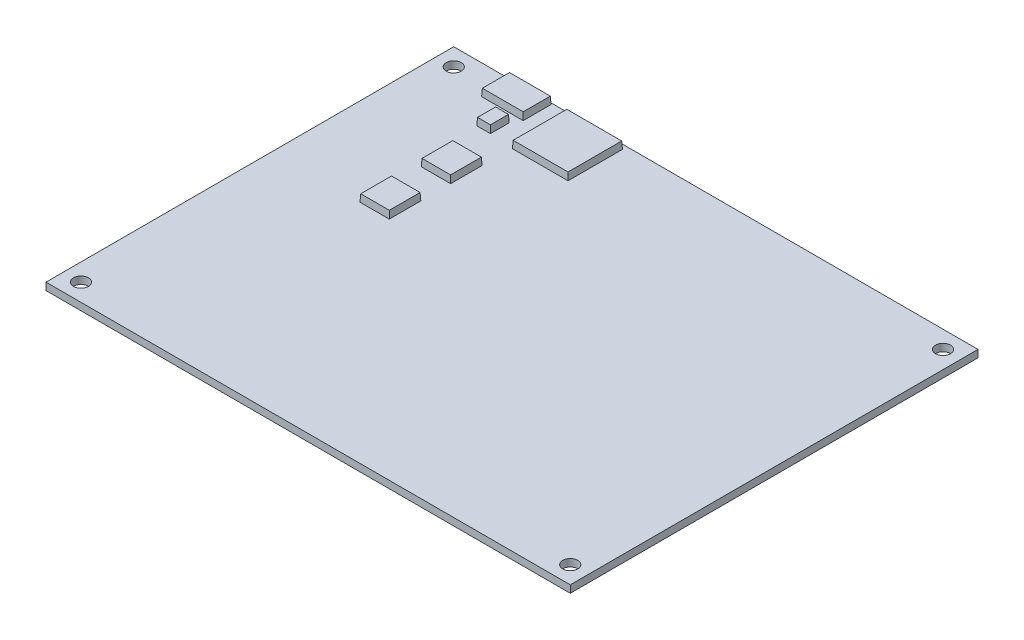
ISO-10303-21;
HEADER;
FILE_DESCRIPTION(('STEP AP214'),'2;1');
FILE_NAME('part.step','',(''),(''),'','','');
FILE_SCHEMA(('AUTOMOTIVE_DESIGN { 1 0 10303 214 1 1 1 1 }'));
ENDSEC;
DATA;
#1=APPLICATION_CONTEXT('core data for automotive mechanical design processes');
#2=APPLICATION_PROTOCOL_DEFINITION('international standard','automotive_design',2000,#1);
#3=PRODUCT_CONTEXT('',#1,'mechanical');
#4=PRODUCT('Part','Part','',(#3));
#5=PRODUCT_RELATED_PRODUCT_CATEGORY('part','',(#4));
#6=PRODUCT_DEFINITION_FORMATION('','',#4);
#7=PRODUCT_DEFINITION_CONTEXT('part definition',#1,'design');
#8=PRODUCT_DEFINITION('design','',#6,#7);
#9=PRODUCT_DEFINITION_SHAPE('','',#8);
#10=(LENGTH_UNIT() NAMED_UNIT(*) SI_UNIT(.MILLI.,.METRE.));
#11=(NAMED_UNIT(*) PLANE_ANGLE_UNIT() SI_UNIT($,.RADIAN.));
#12=(NAMED_UNIT(*) SI_UNIT($,.STERADIAN.) SOLID_ANGLE_UNIT());
#13=UNCERTAINTY_MEASURE_WITH_UNIT(LENGTH_MEASURE(1.E-05),#10,'distance_accuracy_value','');
#14=(GEOMETRIC_REPRESENTATION_CONTEXT(3) GLOBAL_UNCERTAINTY_ASSIGNED_CONTEXT((#13)) GLOBAL_UNIT_ASSIGNED_CONTEXT((#10,
#11,#12)) REPRESENTATION_CONTEXT('',''));
#15=CARTESIAN_POINT('',(0.,0.,0.));
#16=DIRECTION('',(0.,0.,1.));
#17=DIRECTION('',(1.,0.,0.));
#18=AXIS2_PLACEMENT_3D('',#15,#16,#17);
#19=CARTESIAN_POINT('',(57.15,1.6002,-44.45));
#20=DIRECTION('',(0.,-1.,0.));
#21=DIRECTION('',(0.,0.,-1.));
#22=AXIS2_PLACEMENT_3D('',#19,#20,#21);
#23=PLANE('',#22);
#24=DIRECTION('',(0.,0.,1.));
#25=VECTOR('',#24,1.);
#26=CARTESIAN_POINT('',(-31.5034949333632,1.6002,-43.4598801344244));
#27=LINE('',#26,#25);
#28=CARTESIAN_POINT('',(-31.5034949333632,1.6002,-43.4598801344244));
#29=VERTEX_POINT('',#28);
#30=CARTESIAN_POINT('',(-31.5034949333632,1.6002,-31.5915452694734));
#31=VERTEX_POINT('',#30);
#32=EDGE_CURVE('E224',#29,#31,#27,.T.);
#33=ORIENTED_EDGE('',*,*,#32,.F.);
#34=DIRECTION('',(-1.,0.,0.));
#35=VECTOR('',#34,1.);
#36=CARTESIAN_POINT('',(-31.5034949333632,1.6002,-43.4598801344244));
#37=LINE('',#36,#35);
#38=CARTESIAN_POINT('',(-19.3771527887394,1.6002,-43.4598801344244));
#39=VERTEX_POINT('',#38);
#40=EDGE_CURVE('E233',#39,#29,#37,.T.);
#41=ORIENTED_EDGE('',*,*,#40,.F.);
#42=DIRECTION('',(0.,0.,-1.));
#43=VECTOR('',#42,1.);
#44=CARTESIAN_POINT('',(-19.3771527887394,1.6002,-43.4598801344244));
#45=LINE('',#44,#43);
#46=CARTESIAN_POINT('',(-19.3771527887394,1.6002,-31.5915452694734));
#47=VERTEX_POINT('',#46);
#48=EDGE_CURVE('E230',#47,#39,#45,.T.);
#49=ORIENTED_EDGE('',*,*,#48,.F.);
#50=DIRECTION('',(1.,0.,0.));
#51=VECTOR('',#50,1.);
#52=CARTESIAN_POINT('',(-31.5034949333632,1.6002,-31.5915452694734));
#53=LINE('',#52,#51);
#54=EDGE_CURVE('E227',#31,#47,#53,.T.);
#55=ORIENTED_EDGE('',*,*,#54,.F.);
#56=EDGE_LOOP('',(#33,#41,#49,#55));
#57=FACE_BOUND('',#56,.T.);
#58=DIRECTION('',(0.,0.,1.));
#59=VECTOR('',#58,1.);
#60=CARTESIAN_POINT('',(-44.6927167166465,1.6002,-44.1461303469198));
#61=LINE('',#60,#59);
#62=CARTESIAN_POINT('',(-44.6927167166465,1.6002,-44.1461303469198));
#63=VERTEX_POINT('',#62);
#64=CARTESIAN_POINT('',(-44.6927167166465,1.6002,-38.0619014595683));
#65=VERTEX_POINT('',#64);
#66=EDGE_CURVE('E273',#63,#65,#61,.T.);
#67=ORIENTED_EDGE('',*,*,#66,.F.);
#68=DIRECTION('',(-1.,0.,0.));
#69=VECTOR('',#68,1.);
#70=CARTESIAN_POINT('',(-44.6927167166465,1.6002,-44.1461303469198));
#71=LINE('',#70,#69);
#72=CARTESIAN_POINT('',(-35.6248755864591,1.6002,-44.1461303469198));
#73=VERTEX_POINT('',#72);
#74=EDGE_CURVE('E299',#73,#63,#71,.T.);
#75=ORIENTED_EDGE('',*,*,#74,.F.);
#76=DIRECTION('',(0.,0.,-1.));
#77=VECTOR('',#76,1.);
#78=CARTESIAN_POINT('',(-35.6248755864591,1.6002,-44.1461303469198));
#79=LINE('',#78,#77);
#80=CARTESIAN_POINT('',(-35.6248755864591,1.6002,-38.0619014595683));
#81=VERTEX_POINT('',#80);
#82=EDGE_CURVE('E296',#81,#73,#79,.T.);
#83=ORIENTED_EDGE('',*,*,#82,.F.);
#84=DIRECTION('',(1.,0.,0.));
#85=VECTOR('',#84,1.);
#86=CARTESIAN_POINT('',(-44.6927167166465,1.6002,-38.0619014595683));
#87=LINE('',#86,#85);
#88=EDGE_CURVE('E293',#65,#81,#87,.T.);
#89=ORIENTED_EDGE('',*,*,#88,.F.);
#90=EDGE_LOOP('',(#67,#75,#83,#89));
#91=FACE_BOUND('',#90,.T.);
#92=DIRECTION('',(0.,0.,-1.));
#93=VECTOR('',#92,1.);
#94=CARTESIAN_POINT('',(57.15,1.6002,6.35000000000002));
#95=LINE('',#94,#93);
#96=CARTESIAN_POINT('',(57.15,1.6002,44.45));
#97=VERTEX_POINT('',#96);
#98=CARTESIAN_POINT('',(57.15,1.6002,-44.45));
#99=VERTEX_POINT('',#98);
#100=EDGE_CURVE('E381',#97,#99,#95,.T.);
#101=ORIENTED_EDGE('',*,*,#100,.T.);
#102=DIRECTION('',(-1.,0.,0.));
#103=VECTOR('',#102,1.);
#104=CARTESIAN_POINT('',(-57.15,1.6002,-44.45));
#105=LINE('',#104,#103);
#106=CARTESIAN_POINT('',(-57.15,1.6002,-44.45));
#107=VERTEX_POINT('',#106);
#108=EDGE_CURVE('E384',#99,#107,#105,.T.);
#109=ORIENTED_EDGE('',*,*,#108,.T.);
#110=DIRECTION('',(0.,0.,1.));
#111=VECTOR('',#110,1.);
#112=CARTESIAN_POINT('',(-57.15,1.6002,6.35000000000002));
#113=LINE('',#112,#111);
#114=CARTESIAN_POINT('',(-57.15,1.6002,44.45));
#115=VERTEX_POINT('',#114);
#116=EDGE_CURVE('E387',#107,#115,#113,.T.);
#117=ORIENTED_EDGE('',*,*,#116,.T.);
#118=DIRECTION('',(1.,0.,0.));
#119=VECTOR('',#118,1.);
#120=CARTESIAN_POINT('',(-57.15,1.6002,44.45));
#121=LINE('',#120,#119);
#122=EDGE_CURVE('E389',#115,#97,#121,.T.);
#123=ORIENTED_EDGE('',*,*,#122,.T.);
#124=EDGE_LOOP('',(#101,#109,#117,#123));
#125=FACE_BOUND('',#124,.T.);
#126=CARTESIAN_POINT('',(-53.34,1.6002,40.64));
#127=DIRECTION('',(0.,1.,0.));
#128=DIRECTION('',(0.,0.,1.));
#129=AXIS2_PLACEMENT_3D('',#126,#127,#128);
#130=CIRCLE('',#129,1.63194999999999);
#131=CARTESIAN_POINT('',(-53.34,1.6002,42.27195));
#132=VERTEX_POINT('',#131);
#133=EDGE_CURVE('E374',#132,#132,#130,.T.);
#134=ORIENTED_EDGE('',*,*,#133,.F.);
#135=EDGE_LOOP('',(#134));
#136=FACE_BOUND('',#135,.T.);
#137=CARTESIAN_POINT('',(53.34,1.6002,40.64));
#138=DIRECTION('',(0.,1.,0.));
#139=DIRECTION('',(0.,0.,1.));
#140=AXIS2_PLACEMENT_3D('',#137,#138,#139);
#141=CIRCLE('',#140,1.63194999999999);
#142=CARTESIAN_POINT('',(53.34,1.6002,42.27195));
#143=VERTEX_POINT('',#142);
#144=EDGE_CURVE('E368',#143,#143,#141,.T.);
#145=ORIENTED_EDGE('',*,*,#144,.F.);
#146=EDGE_LOOP('',(#145));
#147=FACE_BOUND('',#146,.T.);
#148=CARTESIAN_POINT('',(53.34,1.6002,-40.64));
#149=DIRECTION('',(0.,1.,0.));
#150=DIRECTION('',(0.,0.,1.));
#151=AXIS2_PLACEMENT_3D('',#148,#149,#150);
#152=CIRCLE('',#151,1.63194999999999);
#153=CARTESIAN_POINT('',(53.34,1.6002,-39.00805));
#154=VERTEX_POINT('',#153);
#155=EDGE_CURVE('E362',#154,#154,#152,.T.);
#156=ORIENTED_EDGE('',*,*,#155,.F.);
#157=EDGE_LOOP('',(#156));
#158=FACE_BOUND('',#157,.T.);
#159=CARTESIAN_POINT('',(-53.34,1.6002,-40.64));
#160=DIRECTION('',(0.,1.,0.));
#161=DIRECTION('',(0.,0.,1.));
#162=AXIS2_PLACEMENT_3D('',#159,#160,#161);
#163=CIRCLE('',#162,1.63194999999999);
#164=CARTESIAN_POINT('',(-53.34,1.6002,-39.00805));
#165=VERTEX_POINT('',#164);
#166=EDGE_CURVE('E339',#165,#165,#163,.T.);
#167=ORIENTED_EDGE('',*,*,#166,.F.);
#168=EDGE_LOOP('',(#167));
#169=FACE_BOUND('',#168,.T.);
#170=DIRECTION('',(0.,0.,1.));
#171=VECTOR('',#170,1.);
#172=CARTESIAN_POINT('',(-38.0206695409304,1.6002,-25.1215308192296));
#173=LINE('',#172,#171);
#174=CARTESIAN_POINT('',(-38.0206695409304,1.6002,-25.1215308192296));
#175=VERTEX_POINT('',#174);
#176=CARTESIAN_POINT('',(-38.0206695409304,1.6002,-18.2413366946203));
#177=VERTEX_POINT('',#176);
#178=EDGE_CURVE('E306',#175,#177,#173,.T.);
#179=ORIENTED_EDGE('',*,*,#178,.F.);
#180=DIRECTION('',(-1.,0.,0.));
#181=VECTOR('',#180,1.);
#182=CARTESIAN_POINT('',(-38.0206695409304,1.6002,-25.1215308192296));
#183=LINE('',#182,#181);
#184=CARTESIAN_POINT('',(-31.6279105092975,1.6002,-25.1215308192296));
#185=VERTEX_POINT('',#184);
#186=EDGE_CURVE('E332',#185,#175,#183,.T.);
#187=ORIENTED_EDGE('',*,*,#186,.F.);
#188=DIRECTION('',(0.,0.,-1.));
#189=VECTOR('',#188,1.);
#190=CARTESIAN_POINT('',(-31.6279105092975,1.6002,-25.1215308192296));
#191=LINE('',#190,#189);
#192=CARTESIAN_POINT('',(-31.6279105092975,1.6002,-18.2413366946203));
#193=VERTEX_POINT('',#192);
#194=EDGE_CURVE('E329',#193,#185,#191,.T.);
#195=ORIENTED_EDGE('',*,*,#194,.F.);
#196=DIRECTION('',(1.,0.,0.));
#197=VECTOR('',#196,1.);
#198=CARTESIAN_POINT('',(-38.0206695409304,1.6002,-18.2413366946203));
#199=LINE('',#198,#197);
#200=EDGE_CURVE('E326',#177,#193,#199,.T.);
#201=ORIENTED_EDGE('',*,*,#200,.F.);
#202=EDGE_LOOP('',(#179,#187,#195,#201));
#203=FACE_BOUND('',#202,.T.);
#204=DIRECTION('',(0.,0.,1.));
#205=VECTOR('',#204,1.);
#206=CARTESIAN_POINT('',(-38.0206695409304,1.6002,-11.7502275240392));
#207=LINE('',#206,#205);
#208=CARTESIAN_POINT('',(-38.0206695409304,1.6002,-11.7502275240392));
#209=VERTEX_POINT('',#208);
#210=CARTESIAN_POINT('',(-38.0206695409304,1.6002,-4.87003339942996));
#211=VERTEX_POINT('',#210);
#212=EDGE_CURVE('E240',#209,#211,#207,.T.);
#213=ORIENTED_EDGE('',*,*,#212,.F.);
#214=DIRECTION('',(-1.,0.,0.));
#215=VECTOR('',#214,1.);
#216=CARTESIAN_POINT('',(-38.0206695409304,1.6002,-11.7502275240392));
#217=LINE('',#216,#215);
#218=CARTESIAN_POINT('',(-31.6279105092975,1.6002,-11.7502275240392));
#219=VERTEX_POINT('',#218);
#220=EDGE_CURVE('E266',#219,#209,#217,.T.);
#221=ORIENTED_EDGE('',*,*,#220,.F.);
#222=DIRECTION('',(0.,0.,-1.));
#223=VECTOR('',#222,1.);
#224=CARTESIAN_POINT('',(-31.6279105092975,1.6002,-11.7502275240392));
#225=LINE('',#224,#223);
#226=CARTESIAN_POINT('',(-31.6279105092975,1.6002,-4.87003339942996));
#227=VERTEX_POINT('',#226);
#228=EDGE_CURVE('E263',#227,#219,#225,.T.);
#229=ORIENTED_EDGE('',*,*,#228,.F.);
#230=DIRECTION('',(1.,0.,0.));
#231=VECTOR('',#230,1.);
#232=CARTESIAN_POINT('',(-38.0206695409304,1.6002,-4.87003339942996));
#233=LINE('',#232,#231);
#234=EDGE_CURVE('E260',#211,#227,#233,.T.);
#235=ORIENTED_EDGE('',*,*,#234,.F.);
#236=EDGE_LOOP('',(#213,#221,#229,#235));
#237=FACE_BOUND('',#236,.T.);
#238=DIRECTION('',(0.,0.,1.));
#239=VECTOR('',#238,1.);
#240=CARTESIAN_POINT('',(-39.7200296452534,1.6002,-36.131328831851));
#241=LINE('',#240,#239);
#242=CARTESIAN_POINT('',(-39.7200296452534,1.6002,-36.131328831851));
#243=VERTEX_POINT('',#242);
#244=CARTESIAN_POINT('',(-39.7200296452534,1.6002,-32.0361747730567));
#245=VERTEX_POINT('',#244);
#246=EDGE_CURVE('E189',#243,#245,#241,.T.);
#247=ORIENTED_EDGE('',*,*,#246,.F.);
#248=DIRECTION('',(-1.,0.,0.));
#249=VECTOR('',#248,1.);
#250=CARTESIAN_POINT('',(-39.7200296452534,1.6002,-36.131328831851));
#251=LINE('',#250,#249);
#252=CARTESIAN_POINT('',(-36.7364174024176,1.6002,-36.131328831851));
#253=VERTEX_POINT('',#252);
#254=EDGE_CURVE('E191',#253,#243,#251,.T.);
#255=ORIENTED_EDGE('',*,*,#254,.F.);
#256=DIRECTION('',(0.,0.,-1.));
#257=VECTOR('',#256,1.);
#258=CARTESIAN_POINT('',(-36.7364174024176,1.6002,-36.131328831851));
#259=LINE('',#258,#257);
#260=CARTESIAN_POINT('',(-36.7364174024176,1.6002,-32.0361747730567));
#261=VERTEX_POINT('',#260);
#262=EDGE_CURVE('E52',#261,#253,#259,.T.);
#263=ORIENTED_EDGE('',*,*,#262,.F.);
#264=DIRECTION('',(1.,0.,0.));
#265=VECTOR('',#264,1.);
#266=CARTESIAN_POINT('',(-39.7200296452534,1.6002,-32.0361747730567));
#267=LINE('',#266,#265);
#268=EDGE_CURVE('E47',#245,#261,#267,.T.);
#269=ORIENTED_EDGE('',*,*,#268,.F.);
#270=EDGE_LOOP('',(#247,#255,#263,#269));
#271=FACE_BOUND('',#270,.T.);
#272=ADVANCED_FACE('F32',(#57,#91,#125,#136,#147,#158,#169,#203,#237,#271),#23,.F.);
#273=CARTESIAN_POINT('',(-57.15,1.6002,-44.45));
#274=DIRECTION('',(0.,0.,1.));
#275=DIRECTION('',(1.,0.,0.));
#276=AXIS2_PLACEMENT_3D('',#273,#274,#275);
#277=PLANE('',#276);
#278=DIRECTION('',(-1.,0.,0.));
#279=VECTOR('',#278,1.);
#280=CARTESIAN_POINT('',(-57.15,0.,-44.45));
#281=LINE('',#280,#279);
#282=CARTESIAN_POINT('',(57.15,0.,-44.45));
#283=VERTEX_POINT('',#282);
#284=CARTESIAN_POINT('',(-57.15,0.,-44.45));
#285=VERTEX_POINT('',#284);
#286=EDGE_CURVE('E380',#283,#285,#281,.T.);
#287=ORIENTED_EDGE('',*,*,#286,.T.);
#288=DIRECTION('',(0.,-1.,0.));
#289=VECTOR('',#288,1.);
#290=CARTESIAN_POINT('',(-57.15,1.6002,-44.45));
#291=LINE('',#290,#289);
#292=EDGE_CURVE('E40',#107,#285,#291,.T.);
#293=ORIENTED_EDGE('',*,*,#292,.F.);
#294=ORIENTED_EDGE('',*,*,#108,.F.);
#295=DIRECTION('',(0.,-1.,0.));
#296=VECTOR('',#295,1.);
#297=CARTESIAN_POINT('',(57.15,1.6002,-44.45));
#298=LINE('',#297,#296);
#299=EDGE_CURVE('E11',#99,#283,#298,.T.);
#300=ORIENTED_EDGE('',*,*,#299,.T.);
#301=EDGE_LOOP('',(#287,#293,#294,#300));
#302=FACE_BOUND('',#301,.T.);
#303=ADVANCED_FACE('F34',(#302),#277,.F.);
#304=CARTESIAN_POINT('',(-57.15,1.6002,44.45));
#305=DIRECTION('',(1.,0.,0.));
#306=DIRECTION('',(0.,0.,-1.));
#307=AXIS2_PLACEMENT_3D('',#304,#305,#306);
#308=PLANE('',#307);
#309=DIRECTION('',(0.,0.,1.));
#310=VECTOR('',#309,1.);
#311=CARTESIAN_POINT('',(-57.15,0.,44.45));
#312=LINE('',#311,#310);
#313=CARTESIAN_POINT('',(-57.15,0.,44.45));
#314=VERTEX_POINT('',#313);
#315=EDGE_CURVE('E394',#285,#314,#312,.T.);
#316=ORIENTED_EDGE('',*,*,#315,.T.);
#317=DIRECTION('',(0.,-1.,0.));
#318=VECTOR('',#317,1.);
#319=CARTESIAN_POINT('',(-57.15,1.6002,44.45));
#320=LINE('',#319,#318);
#321=EDGE_CURVE('E402',#115,#314,#320,.T.);
#322=ORIENTED_EDGE('',*,*,#321,.F.);
#323=ORIENTED_EDGE('',*,*,#116,.F.);
#324=ORIENTED_EDGE('',*,*,#292,.T.);
#325=EDGE_LOOP('',(#316,#322,#323,#324));
#326=FACE_BOUND('',#325,.T.);
#327=ADVANCED_FACE('F408',(#326),#308,.F.);
#328=CARTESIAN_POINT('',(57.15,1.6002,44.45));
#329=DIRECTION('',(0.,0.,-1.));
#330=DIRECTION('',(-1.,0.,0.));
#331=AXIS2_PLACEMENT_3D('',#328,#329,#330);
#332=PLANE('',#331);
#333=DIRECTION('',(1.,0.,0.));
#334=VECTOR('',#333,1.);
#335=CARTESIAN_POINT('',(57.15,0.,44.45));
#336=LINE('',#335,#334);
#337=CARTESIAN_POINT('',(57.15,0.,44.45));
#338=VERTEX_POINT('',#337);
#339=EDGE_CURVE('E397',#314,#338,#336,.T.);
#340=ORIENTED_EDGE('',*,*,#339,.T.);
#341=DIRECTION('',(0.,-1.,0.));
#342=VECTOR('',#341,1.);
#343=CARTESIAN_POINT('',(57.15,1.6002,44.45));
#344=LINE('',#343,#342);
#345=EDGE_CURVE('E391',#97,#338,#344,.T.);
#346=ORIENTED_EDGE('',*,*,#345,.F.);
#347=ORIENTED_EDGE('',*,*,#122,.F.);
#348=ORIENTED_EDGE('',*,*,#321,.T.);
#349=EDGE_LOOP('',(#340,#346,#347,#348));
#350=FACE_BOUND('',#349,.T.);
#351=ADVANCED_FACE('F418',(#350),#332,.F.);
#352=CARTESIAN_POINT('',(57.15,1.6002,44.45));
#353=DIRECTION('',(-1.,0.,0.));
#354=DIRECTION('',(0.,0.,1.));
#355=AXIS2_PLACEMENT_3D('',#352,#353,#354);
#356=PLANE('',#355);
#357=DIRECTION('',(0.,0.,-1.));
#358=VECTOR('',#357,1.);
#359=CARTESIAN_POINT('',(57.15,0.,44.45));
#360=LINE('',#359,#358);
#361=EDGE_CURVE('E385',#338,#283,#360,.T.);
#362=ORIENTED_EDGE('',*,*,#361,.T.);
#363=ORIENTED_EDGE('',*,*,#299,.F.);
#364=ORIENTED_EDGE('',*,*,#100,.F.);
#365=ORIENTED_EDGE('',*,*,#345,.T.);
#366=EDGE_LOOP('',(#362,#363,#364,#365));
#367=FACE_BOUND('',#366,.T.);
#368=ADVANCED_FACE('F422',(#367),#356,.F.);
#369=CARTESIAN_POINT('',(57.15,0.,-44.45));
#370=DIRECTION('',(0.,-1.,0.));
#371=DIRECTION('',(0.,0.,-1.));
#372=AXIS2_PLACEMENT_3D('',#369,#370,#371);
#373=PLANE('',#372);
#374=CARTESIAN_POINT('',(-53.34,0.,-40.64));
#375=DIRECTION('',(0.,1.,0.));
#376=DIRECTION('',(0.,0.,1.));
#377=AXIS2_PLACEMENT_3D('',#374,#375,#376);
#378=CIRCLE('',#377,1.63195);
#379=CARTESIAN_POINT('',(-53.34,0.,-39.00805));
#380=VERTEX_POINT('',#379);
#381=EDGE_CURVE('E359',#380,#380,#378,.T.);
#382=ORIENTED_EDGE('',*,*,#381,.T.);
#383=EDGE_LOOP('',(#382));
#384=FACE_BOUND('',#383,.T.);
#385=CARTESIAN_POINT('',(53.34,0.,-40.64));
#386=DIRECTION('',(0.,1.,0.));
#387=DIRECTION('',(0.,0.,1.));
#388=AXIS2_PLACEMENT_3D('',#385,#386,#387);
#389=CIRCLE('',#388,1.63195);
#390=CARTESIAN_POINT('',(53.34,0.,-39.00805));
#391=VERTEX_POINT('',#390);
#392=EDGE_CURVE('E365',#391,#391,#389,.T.);
#393=ORIENTED_EDGE('',*,*,#392,.T.);
#394=EDGE_LOOP('',(#393));
#395=FACE_BOUND('',#394,.T.);
#396=CARTESIAN_POINT('',(53.34,0.,40.64));
#397=DIRECTION('',(0.,1.,0.));
#398=DIRECTION('',(0.,0.,1.));
#399=AXIS2_PLACEMENT_3D('',#396,#397,#398);
#400=CIRCLE('',#399,1.63195);
#401=CARTESIAN_POINT('',(53.34,0.,42.27195));
#402=VERTEX_POINT('',#401);
#403=EDGE_CURVE('E371',#402,#402,#400,.T.);
#404=ORIENTED_EDGE('',*,*,#403,.T.);
#405=EDGE_LOOP('',(#404));
#406=FACE_BOUND('',#405,.T.);
#407=CARTESIAN_POINT('',(-53.34,0.,40.64));
#408=DIRECTION('',(0.,1.,0.));
#409=DIRECTION('',(0.,0.,1.));
#410=AXIS2_PLACEMENT_3D('',#407,#408,#409);
#411=CIRCLE('',#410,1.63195);
#412=CARTESIAN_POINT('',(-53.34,0.,42.27195));
#413=VERTEX_POINT('',#412);
#414=EDGE_CURVE('E377',#413,#413,#411,.T.);
#415=ORIENTED_EDGE('',*,*,#414,.T.);
#416=EDGE_LOOP('',(#415));
#417=FACE_BOUND('',#416,.T.);
#418=ORIENTED_EDGE('',*,*,#286,.F.);
#419=ORIENTED_EDGE('',*,*,#361,.F.);
#420=ORIENTED_EDGE('',*,*,#339,.F.);
#421=ORIENTED_EDGE('',*,*,#315,.F.);
#422=EDGE_LOOP('',(#418,#419,#420,#421));
#423=FACE_BOUND('',#422,.T.);
#424=ADVANCED_FACE('F415',(#384,#395,#406,#417,#423),#373,.T.);
#425=CARTESIAN_POINT('',(-53.34,1.6002,40.64));
#426=DIRECTION('',(0.,1.,0.));
#427=DIRECTION('',(0.,0.,1.));
#428=AXIS2_PLACEMENT_3D('',#425,#426,#427);
#429=CYLINDRICAL_SURFACE('',#428,1.63194999999999);
#430=ORIENTED_EDGE('',*,*,#414,.F.);
#431=EDGE_LOOP('',(#430));
#432=FACE_BOUND('',#431,.T.);
#433=ORIENTED_EDGE('',*,*,#133,.T.);
#434=EDGE_LOOP('',(#433));
#435=FACE_BOUND('',#434,.T.);
#436=ADVANCED_FACE('F515',(#432,#435),#429,.F.);
#437=CARTESIAN_POINT('',(53.34,1.6002,40.64));
#438=DIRECTION('',(0.,1.,0.));
#439=DIRECTION('',(0.,0.,1.));
#440=AXIS2_PLACEMENT_3D('',#437,#438,#439);
#441=CYLINDRICAL_SURFACE('',#440,1.63194999999999);
#442=ORIENTED_EDGE('',*,*,#403,.F.);
#443=EDGE_LOOP('',(#442));
#444=FACE_BOUND('',#443,.T.);
#445=ORIENTED_EDGE('',*,*,#144,.T.);
#446=EDGE_LOOP('',(#445));
#447=FACE_BOUND('',#446,.T.);
#448=ADVANCED_FACE('F511',(#444,#447),#441,.F.);
#449=CARTESIAN_POINT('',(53.34,1.6002,-40.64));
#450=DIRECTION('',(0.,1.,0.));
#451=DIRECTION('',(0.,0.,1.));
#452=AXIS2_PLACEMENT_3D('',#449,#450,#451);
#453=CYLINDRICAL_SURFACE('',#452,1.63194999999999);
#454=ORIENTED_EDGE('',*,*,#392,.F.);
#455=EDGE_LOOP('',(#454));
#456=FACE_BOUND('',#455,.T.);
#457=ORIENTED_EDGE('',*,*,#155,.T.);
#458=EDGE_LOOP('',(#457));
#459=FACE_BOUND('',#458,.T.);
#460=ADVANCED_FACE('F507',(#456,#459),#453,.F.);
#461=CARTESIAN_POINT('',(-53.34,1.6002,-40.64));
#462=DIRECTION('',(0.,1.,0.));
#463=DIRECTION('',(0.,0.,1.));
#464=AXIS2_PLACEMENT_3D('',#461,#462,#463);
#465=CYLINDRICAL_SURFACE('',#464,1.63194999999999);
#466=ORIENTED_EDGE('',*,*,#381,.F.);
#467=EDGE_LOOP('',(#466));
#468=FACE_BOUND('',#467,.T.);
#469=ORIENTED_EDGE('',*,*,#166,.T.);
#470=EDGE_LOOP('',(#469));
#471=FACE_BOUND('',#470,.T.);
#472=ADVANCED_FACE('F493',(#468,#471),#465,.F.);
#473=CARTESIAN_POINT('',(-38.0206695409304,1.6002,-25.1215308192296));
#474=DIRECTION('',(-0.998629534754574,0.0523359562429439,0.));
#475=DIRECTION('',(-0.052335956242944,-0.998629534754574,0.));
#476=AXIS2_PLACEMENT_3D('',#473,#474,#475);
#477=PLANE('',#476);
#478=ORIENTED_EDGE('',*,*,#178,.T.);
#479=DIRECTION('',(-0.052264427688714,-0.997264688634237,0.052264427688714));
#480=VECTOR('',#479,1.);
#481=CARTESIAN_POINT('',(-38.0206695409304,1.6002,-18.2413366946203));
#482=LINE('',#481,#480);
#483=CARTESIAN_POINT('',(-37.9374721913186,3.1877,-18.3245340442322));
#484=VERTEX_POINT('',#483);
#485=EDGE_CURVE('E336',#484,#177,#482,.T.);
#486=ORIENTED_EDGE('',*,*,#485,.F.);
#487=DIRECTION('',(0.,0.,-1.));
#488=VECTOR('',#487,1.);
#489=CARTESIAN_POINT('',(-37.9374721913186,3.1877,-25.1215308192296));
#490=LINE('',#489,#488);
#491=CARTESIAN_POINT('',(-37.9374721913186,3.1877,-25.0383334696178));
#492=VERTEX_POINT('',#491);
#493=EDGE_CURVE('E335',#492,#484,#490,.F.);
#494=ORIENTED_EDGE('',*,*,#493,.F.);
#495=DIRECTION('',(-0.052264427688714,-0.997264688634237,-0.052264427688714));
#496=VECTOR('',#495,1.);
#497=CARTESIAN_POINT('',(-38.0206695409304,1.6002,-25.1215308192296));
#498=LINE('',#497,#496);
#499=EDGE_CURVE('E341',#492,#175,#498,.T.);
#500=ORIENTED_EDGE('',*,*,#499,.T.);
#501=EDGE_LOOP('',(#478,#486,#494,#500));
#502=FACE_BOUND('',#501,.T.);
#503=ADVANCED_FACE('F489',(#502),#477,.T.);
#504=CARTESIAN_POINT('',(-38.0206695409304,1.6002,-18.2413366946203));
#505=DIRECTION('',(0.,0.0523359562429439,0.998629534754574));
#506=DIRECTION('',(0.,-0.998629534754574,0.052335956242944));
#507=AXIS2_PLACEMENT_3D('',#504,#505,#506);
#508=PLANE('',#507);
#509=ORIENTED_EDGE('',*,*,#200,.T.);
#510=DIRECTION('',(0.052264427688714,-0.997264688634237,0.052264427688714));
#511=VECTOR('',#510,1.);
#512=CARTESIAN_POINT('',(-31.6467042439257,1.9588058193144,-18.2601304292486));
#513=LINE('',#512,#511);
#514=CARTESIAN_POINT('',(-31.7111078589093,3.1877,-18.3245340442322));
#515=VERTEX_POINT('',#514);
#516=EDGE_CURVE('E340',#515,#193,#513,.T.);
#517=ORIENTED_EDGE('',*,*,#516,.F.);
#518=DIRECTION('',(-1.,0.,0.));
#519=VECTOR('',#518,1.);
#520=CARTESIAN_POINT('',(-38.0206695409304,3.1877,-18.3245340442322));
#521=LINE('',#520,#519);
#522=EDGE_CURVE('E352',#484,#515,#521,.F.);
#523=ORIENTED_EDGE('',*,*,#522,.F.);
#524=ORIENTED_EDGE('',*,*,#485,.T.);
#525=EDGE_LOOP('',(#509,#517,#523,#524));
#526=FACE_BOUND('',#525,.T.);
#527=ADVANCED_FACE('F492',(#526),#508,.T.);
#528=CARTESIAN_POINT('',(-31.6279105092975,1.6002,-25.1215308192296));
#529=DIRECTION('',(0.998629534754574,0.0523359562429439,0.));
#530=DIRECTION('',(-0.052335956242944,0.998629534754574,0.));
#531=AXIS2_PLACEMENT_3D('',#528,#529,#530);
#532=PLANE('',#531);
#533=ORIENTED_EDGE('',*,*,#194,.T.);
#534=DIRECTION('',(0.052264427688714,-0.997264688634237,-0.052264427688714));
#535=VECTOR('',#534,1.);
#536=CARTESIAN_POINT('',(-31.6453727806531,1.93339998661352,-25.104068547874));
#537=LINE('',#536,#535);
#538=CARTESIAN_POINT('',(-31.7111078589093,3.1877,-25.0383334696178));
#539=VERTEX_POINT('',#538);
#540=EDGE_CURVE('E344',#539,#185,#537,.T.);
#541=ORIENTED_EDGE('',*,*,#540,.F.);
#542=DIRECTION('',(0.,0.,1.));
#543=VECTOR('',#542,1.);
#544=CARTESIAN_POINT('',(-31.7111078589093,3.1877,-25.1215308192296));
#545=LINE('',#544,#543);
#546=EDGE_CURVE('E354',#515,#539,#545,.F.);
#547=ORIENTED_EDGE('',*,*,#546,.F.);
#548=ORIENTED_EDGE('',*,*,#516,.T.);
#549=EDGE_LOOP('',(#533,#541,#547,#548));
#550=FACE_BOUND('',#549,.T.);
#551=ADVANCED_FACE('F497',(#550),#532,.T.);
#552=CARTESIAN_POINT('',(-38.0206695409304,1.6002,-25.1215308192296));
#553=DIRECTION('',(0.,0.0523359562429439,-0.998629534754574));
#554=DIRECTION('',(0.,0.998629534754574,0.052335956242944));
#555=AXIS2_PLACEMENT_3D('',#552,#553,#554);
#556=PLANE('',#555);
#557=ORIENTED_EDGE('',*,*,#186,.T.);
#558=ORIENTED_EDGE('',*,*,#499,.F.);
#559=DIRECTION('',(1.,0.,0.));
#560=VECTOR('',#559,1.);
#561=CARTESIAN_POINT('',(-38.0206695409304,3.1877,-25.0383334696178));
#562=LINE('',#561,#560);
#563=EDGE_CURVE('E345',#539,#492,#562,.F.);
#564=ORIENTED_EDGE('',*,*,#563,.F.);
#565=ORIENTED_EDGE('',*,*,#540,.T.);
#566=EDGE_LOOP('',(#557,#558,#564,#565));
#567=FACE_BOUND('',#566,.T.);
#568=ADVANCED_FACE('F487',(#567),#556,.T.);
#569=CARTESIAN_POINT('',(-38.0206695409304,3.1877,-18.2413366946203));
#570=DIRECTION('',(0.,1.,0.));
#571=DIRECTION('',(0.,0.,1.));
#572=AXIS2_PLACEMENT_3D('',#569,#570,#571);
#573=PLANE('',#572);
#574=ORIENTED_EDGE('',*,*,#493,.T.);
#575=ORIENTED_EDGE('',*,*,#522,.T.);
#576=ORIENTED_EDGE('',*,*,#546,.T.);
#577=ORIENTED_EDGE('',*,*,#563,.T.);
#578=EDGE_LOOP('',(#574,#575,#576,#577));
#579=FACE_BOUND('',#578,.T.);
#580=ADVANCED_FACE('F473',(#579),#573,.T.);
#581=CARTESIAN_POINT('',(-44.6927167166465,1.6002,-44.1461303469198));
#582=DIRECTION('',(-0.998629534754574,0.0523359562429439,0.));
#583=DIRECTION('',(-0.052335956242944,-0.998629534754574,0.));
#584=AXIS2_PLACEMENT_3D('',#581,#582,#583);
#585=PLANE('',#584);
#586=ORIENTED_EDGE('',*,*,#66,.T.);
#587=DIRECTION('',(-0.052264427688714,-0.997264688634237,0.052264427688714));
#588=VECTOR('',#587,1.);
#589=CARTESIAN_POINT('',(-44.6927167166465,1.6002,-38.0619014595683));
#590=LINE('',#589,#588);
#591=CARTESIAN_POINT('',(-44.6095193670347,3.1877,-38.1450988091801));
#592=VERTEX_POINT('',#591);
#593=EDGE_CURVE('E303',#592,#65,#590,.T.);
#594=ORIENTED_EDGE('',*,*,#593,.F.);
#595=DIRECTION('',(0.,0.,-1.));
#596=VECTOR('',#595,1.);
#597=CARTESIAN_POINT('',(-44.6095193670347,3.1877,-44.1461303469198));
#598=LINE('',#597,#596);
#599=CARTESIAN_POINT('',(-44.6095193670347,3.1877,-44.062932997308));
#600=VERTEX_POINT('',#599);
#601=EDGE_CURVE('E302',#600,#592,#598,.F.);
#602=ORIENTED_EDGE('',*,*,#601,.F.);
#603=DIRECTION('',(-0.052264427688714,-0.997264688634237,-0.052264427688714));
#604=VECTOR('',#603,1.);
#605=CARTESIAN_POINT('',(-44.6927167166465,1.6002,-44.1461303469198));
#606=LINE('',#605,#604);
#607=EDGE_CURVE('E308',#600,#63,#606,.T.);
#608=ORIENTED_EDGE('',*,*,#607,.T.);
#609=EDGE_LOOP('',(#586,#594,#602,#608));
#610=FACE_BOUND('',#609,.T.);
#611=ADVANCED_FACE('F469',(#610),#585,.T.);
#612=CARTESIAN_POINT('',(-44.6927167166465,1.6002,-38.0619014595683));
#613=DIRECTION('',(0.,0.0523359562429439,0.998629534754574));
#614=DIRECTION('',(0.,-0.998629534754574,0.052335956242944));
#615=AXIS2_PLACEMENT_3D('',#612,#613,#614);
#616=PLANE('',#615);
#617=ORIENTED_EDGE('',*,*,#88,.T.);
#618=DIRECTION('',(0.052264427688714,-0.997264688634237,0.052264427688714));
#619=VECTOR('',#618,1.);
#620=CARTESIAN_POINT('',(-35.6414950860045,1.91731894250788,-38.0785209591137));
#621=LINE('',#620,#619);
#622=CARTESIAN_POINT('',(-35.7080729360709,3.1877,-38.1450988091801));
#623=VERTEX_POINT('',#622);
#624=EDGE_CURVE('E307',#623,#81,#621,.T.);
#625=ORIENTED_EDGE('',*,*,#624,.F.);
#626=DIRECTION('',(-1.,0.,0.));
#627=VECTOR('',#626,1.);
#628=CARTESIAN_POINT('',(-44.6927167166465,3.1877,-38.1450988091801));
#629=LINE('',#628,#627);
#630=EDGE_CURVE('E319',#592,#623,#629,.F.);
#631=ORIENTED_EDGE('',*,*,#630,.F.);
#632=ORIENTED_EDGE('',*,*,#593,.T.);
#633=EDGE_LOOP('',(#617,#625,#631,#632));
#634=FACE_BOUND('',#633,.T.);
#635=ADVANCED_FACE('F472',(#634),#616,.T.);
#636=CARTESIAN_POINT('',(-35.6248755864591,1.6002,-44.1461303469198));
#637=DIRECTION('',(0.998629534754574,0.0523359562429439,0.));
#638=DIRECTION('',(-0.052335956242944,0.998629534754574,0.));
#639=AXIS2_PLACEMENT_3D('',#636,#637,#638);
#640=PLANE('',#639);
#641=ORIENTED_EDGE('',*,*,#82,.T.);
#642=DIRECTION('',(0.052264427688714,-0.997264688634237,-0.052264427688714));
#643=VECTOR('',#642,1.);
#644=CARTESIAN_POINT('',(-35.649645032897,2.07282919316078,-44.1213609004819));
#645=LINE('',#644,#643);
#646=CARTESIAN_POINT('',(-35.7080729360709,3.1877,-44.062932997308));
#647=VERTEX_POINT('',#646);
#648=EDGE_CURVE('E311',#647,#73,#645,.T.);
#649=ORIENTED_EDGE('',*,*,#648,.F.);
#650=DIRECTION('',(0.,0.,1.));
#651=VECTOR('',#650,1.);
#652=CARTESIAN_POINT('',(-35.7080729360709,3.1877,-44.1461303469198));
#653=LINE('',#652,#651);
#654=EDGE_CURVE('E321',#623,#647,#653,.F.);
#655=ORIENTED_EDGE('',*,*,#654,.F.);
#656=ORIENTED_EDGE('',*,*,#624,.T.);
#657=EDGE_LOOP('',(#641,#649,#655,#656));
#658=FACE_BOUND('',#657,.T.);
#659=ADVANCED_FACE('F477',(#658),#640,.T.);
#660=CARTESIAN_POINT('',(-44.6927167166465,1.6002,-44.1461303469198));
#661=DIRECTION('',(0.,0.0523359562429439,-0.998629534754574));
#662=DIRECTION('',(0.,0.998629534754574,0.052335956242944));
#663=AXIS2_PLACEMENT_3D('',#660,#661,#662);
#664=PLANE('',#663);
#665=ORIENTED_EDGE('',*,*,#74,.T.);
#666=ORIENTED_EDGE('',*,*,#607,.F.);
#667=DIRECTION('',(1.,0.,0.));
#668=VECTOR('',#667,1.);
#669=CARTESIAN_POINT('',(-44.6927167166465,3.1877,-44.062932997308));
#670=LINE('',#669,#668);
#671=EDGE_CURVE('E312',#647,#600,#670,.F.);
#672=ORIENTED_EDGE('',*,*,#671,.F.);
#673=ORIENTED_EDGE('',*,*,#648,.T.);
#674=EDGE_LOOP('',(#665,#666,#672,#673));
#675=FACE_BOUND('',#674,.T.);
#676=ADVANCED_FACE('F467',(#675),#664,.T.);
#677=CARTESIAN_POINT('',(-44.6927167166465,3.1877,-38.0619014595683));
#678=DIRECTION('',(0.,1.,0.));
#679=DIRECTION('',(0.,0.,1.));
#680=AXIS2_PLACEMENT_3D('',#677,#678,#679);
#681=PLANE('',#680);
#682=ORIENTED_EDGE('',*,*,#601,.T.);
#683=ORIENTED_EDGE('',*,*,#630,.T.);
#684=ORIENTED_EDGE('',*,*,#654,.T.);
#685=ORIENTED_EDGE('',*,*,#671,.T.);
#686=EDGE_LOOP('',(#682,#683,#684,#685));
#687=FACE_BOUND('',#686,.T.);
#688=ADVANCED_FACE('F461',(#687),#681,.T.);
#689=CARTESIAN_POINT('',(-38.0206695409304,1.6002,-11.7502275240392));
#690=DIRECTION('',(-0.998629534754574,0.0523359562429439,0.));
#691=DIRECTION('',(-0.052335956242944,-0.998629534754574,0.));
#692=AXIS2_PLACEMENT_3D('',#689,#690,#691);
#693=PLANE('',#692);
#694=ORIENTED_EDGE('',*,*,#212,.T.);
#695=DIRECTION('',(-0.052264427688714,-0.997264688634237,0.052264427688714));
#696=VECTOR('',#695,1.);
#697=CARTESIAN_POINT('',(-38.0206695409304,1.6002,-4.87003339942996));
#698=LINE('',#697,#696);
#699=CARTESIAN_POINT('',(-37.9374721913186,3.1877,-4.95323074904179));
#700=VERTEX_POINT('',#699);
#701=EDGE_CURVE('E270',#700,#211,#698,.T.);
#702=ORIENTED_EDGE('',*,*,#701,.F.);
#703=DIRECTION('',(0.,0.,-1.));
#704=VECTOR('',#703,1.);
#705=CARTESIAN_POINT('',(-37.9374721913186,3.1877,-11.7502275240392));
#706=LINE('',#705,#704);
#707=CARTESIAN_POINT('',(-37.9374721913186,3.1877,-11.6670301744274));
#708=VERTEX_POINT('',#707);
#709=EDGE_CURVE('E269',#708,#700,#706,.F.);
#710=ORIENTED_EDGE('',*,*,#709,.F.);
#711=DIRECTION('',(-0.052264427688714,-0.997264688634237,-0.052264427688714));
#712=VECTOR('',#711,1.);
#713=CARTESIAN_POINT('',(-38.0206695409304,1.6002,-11.7502275240392));
#714=LINE('',#713,#712);
#715=EDGE_CURVE('E275',#708,#209,#714,.T.);
#716=ORIENTED_EDGE('',*,*,#715,.T.);
#717=EDGE_LOOP('',(#694,#702,#710,#716));
#718=FACE_BOUND('',#717,.T.);
#719=ADVANCED_FACE('F445',(#718),#693,.T.);
#720=CARTESIAN_POINT('',(-38.0206695409304,1.6002,-4.87003339942996));
#721=DIRECTION('',(0.,0.0523359562429439,0.998629534754574));
#722=DIRECTION('',(0.,-0.998629534754574,0.052335956242944));
#723=AXIS2_PLACEMENT_3D('',#720,#721,#722);
#724=PLANE('',#723);
#725=ORIENTED_EDGE('',*,*,#234,.T.);
#726=DIRECTION('',(0.052264427688714,-0.997264688634237,0.052264427688714));
#727=VECTOR('',#726,1.);
#728=CARTESIAN_POINT('',(-31.6467042439257,1.9588058193144,-4.8888271340582));
#729=LINE('',#728,#727);
#730=CARTESIAN_POINT('',(-31.7111078589093,3.1877,-4.95323074904179));
#731=VERTEX_POINT('',#730);
#732=EDGE_CURVE('E274',#731,#227,#729,.T.);
#733=ORIENTED_EDGE('',*,*,#732,.F.);
#734=DIRECTION('',(-1.,0.,0.));
#735=VECTOR('',#734,1.);
#736=CARTESIAN_POINT('',(-38.0206695409304,3.1877,-4.95323074904179));
#737=LINE('',#736,#735);
#738=EDGE_CURVE('E286',#700,#731,#737,.F.);
#739=ORIENTED_EDGE('',*,*,#738,.F.);
#740=ORIENTED_EDGE('',*,*,#701,.T.);
#741=EDGE_LOOP('',(#725,#733,#739,#740));
#742=FACE_BOUND('',#741,.T.);
#743=ADVANCED_FACE('F453',(#742),#724,.T.);
#744=CARTESIAN_POINT('',(-31.6279105092975,1.6002,-11.7502275240392));
#745=DIRECTION('',(0.998629534754574,0.0523359562429439,0.));
#746=DIRECTION('',(-0.052335956242944,0.998629534754574,0.));
#747=AXIS2_PLACEMENT_3D('',#744,#745,#746);
#748=PLANE('',#747);
#749=ORIENTED_EDGE('',*,*,#228,.T.);
#750=DIRECTION('',(0.052264427688714,-0.997264688634237,-0.052264427688714));
#751=VECTOR('',#750,1.);
#752=CARTESIAN_POINT('',(-31.6453727806531,1.93339998661352,-11.7327652526837));
#753=LINE('',#752,#751);
#754=CARTESIAN_POINT('',(-31.7111078589093,3.1877,-11.6670301744274));
#755=VERTEX_POINT('',#754);
#756=EDGE_CURVE('E278',#755,#219,#753,.T.);
#757=ORIENTED_EDGE('',*,*,#756,.F.);
#758=DIRECTION('',(0.,0.,1.));
#759=VECTOR('',#758,1.);
#760=CARTESIAN_POINT('',(-31.7111078589093,3.1877,-11.7502275240392));
#761=LINE('',#760,#759);
#762=EDGE_CURVE('E288',#731,#755,#761,.F.);
#763=ORIENTED_EDGE('',*,*,#762,.F.);
#764=ORIENTED_EDGE('',*,*,#732,.T.);
#765=EDGE_LOOP('',(#749,#757,#763,#764));
#766=FACE_BOUND('',#765,.T.);
#767=ADVANCED_FACE('F451',(#766),#748,.T.);
#768=CARTESIAN_POINT('',(-38.0206695409304,1.6002,-11.7502275240392));
#769=DIRECTION('',(0.,0.0523359562429439,-0.998629534754574));
#770=DIRECTION('',(0.,0.998629534754574,0.052335956242944));
#771=AXIS2_PLACEMENT_3D('',#768,#769,#770);
#772=PLANE('',#771);
#773=ORIENTED_EDGE('',*,*,#220,.T.);
#774=ORIENTED_EDGE('',*,*,#715,.F.);
#775=DIRECTION('',(1.,0.,0.));
#776=VECTOR('',#775,1.);
#777=CARTESIAN_POINT('',(-38.0206695409304,3.1877,-11.6670301744274));
#778=LINE('',#777,#776);
#779=EDGE_CURVE('E279',#755,#708,#778,.F.);
#780=ORIENTED_EDGE('',*,*,#779,.F.);
#781=ORIENTED_EDGE('',*,*,#756,.T.);
#782=EDGE_LOOP('',(#773,#774,#780,#781));
#783=FACE_BOUND('',#782,.T.);
#784=ADVANCED_FACE('F441',(#783),#772,.T.);
#785=CARTESIAN_POINT('',(-38.0206695409304,3.1877,-4.87003339942996));
#786=DIRECTION('',(0.,1.,0.));
#787=DIRECTION('',(0.,0.,1.));
#788=AXIS2_PLACEMENT_3D('',#785,#786,#787);
#789=PLANE('',#788);
#790=ORIENTED_EDGE('',*,*,#709,.T.);
#791=ORIENTED_EDGE('',*,*,#738,.T.);
#792=ORIENTED_EDGE('',*,*,#762,.T.);
#793=ORIENTED_EDGE('',*,*,#779,.T.);
#794=EDGE_LOOP('',(#790,#791,#792,#793));
#795=FACE_BOUND('',#794,.T.);
#796=ADVANCED_FACE('F447',(#795),#789,.T.);
#797=CARTESIAN_POINT('',(-31.5034949333632,1.6002,-43.4598801344244));
#798=DIRECTION('',(-0.998629534754574,0.0523359562429439,0.));
#799=DIRECTION('',(-0.052335956242944,-0.998629534754574,0.));
#800=AXIS2_PLACEMENT_3D('',#797,#798,#799);
#801=PLANE('',#800);
#802=ORIENTED_EDGE('',*,*,#32,.T.);
#803=DIRECTION('',(-0.052264427688714,-0.997264688634237,0.052264427688714));
#804=VECTOR('',#803,1.);
#805=CARTESIAN_POINT('',(-31.5034949333632,1.6002,-31.5915452694734));
#806=LINE('',#805,#804);
#807=CARTESIAN_POINT('',(-31.4202975837514,3.1877,-31.6747426190852));
#808=VERTEX_POINT('',#807);
#809=EDGE_CURVE('E237',#808,#31,#806,.T.);
#810=ORIENTED_EDGE('',*,*,#809,.F.);
#811=DIRECTION('',(0.,0.,-1.));
#812=VECTOR('',#811,1.);
#813=CARTESIAN_POINT('',(-31.4202975837514,3.1877,-43.4598801344244));
#814=LINE('',#813,#812);
#815=CARTESIAN_POINT('',(-31.4202975837514,3.1877,-43.3766827848125));
#816=VERTEX_POINT('',#815);
#817=EDGE_CURVE('E236',#816,#808,#814,.F.);
#818=ORIENTED_EDGE('',*,*,#817,.F.);
#819=DIRECTION('',(-0.052264427688714,-0.997264688634237,-0.052264427688714));
#820=VECTOR('',#819,1.);
#821=CARTESIAN_POINT('',(-31.5034949333632,1.6002,-43.4598801344244));
#822=LINE('',#821,#820);
#823=EDGE_CURVE('E242',#816,#29,#822,.T.);
#824=ORIENTED_EDGE('',*,*,#823,.T.);
#825=EDGE_LOOP('',(#802,#810,#818,#824));
#826=FACE_BOUND('',#825,.T.);
#827=ADVANCED_FACE('F682',(#826),#801,.T.);
#828=CARTESIAN_POINT('',(-31.5034949333632,1.6002,-31.5915452694734));
#829=DIRECTION('',(0.,0.0523359562429439,0.998629534754574));
#830=DIRECTION('',(0.,-0.998629534754574,0.052335956242944));
#831=AXIS2_PLACEMENT_3D('',#828,#829,#830);
#832=PLANE('',#831);
#833=ORIENTED_EDGE('',*,*,#54,.T.);
#834=DIRECTION('',(0.052264427688714,-0.997264688634237,0.052264427688714));
#835=VECTOR('',#834,1.);
#836=CARTESIAN_POINT('',(-19.4095719809731,2.21879503831734,-31.6239644617071));
#837=LINE('',#836,#835);
#838=CARTESIAN_POINT('',(-19.4603501383512,3.1877,-31.6747426190852));
#839=VERTEX_POINT('',#838);
#840=EDGE_CURVE('E241',#839,#47,#837,.T.);
#841=ORIENTED_EDGE('',*,*,#840,.F.);
#842=DIRECTION('',(-1.,0.,0.));
#843=VECTOR('',#842,1.);
#844=CARTESIAN_POINT('',(-31.5034949333632,3.1877,-31.6747426190852));
#845=LINE('',#844,#843);
#846=EDGE_CURVE('E253',#808,#839,#845,.F.);
#847=ORIENTED_EDGE('',*,*,#846,.F.);
#848=ORIENTED_EDGE('',*,*,#809,.T.);
#849=EDGE_LOOP('',(#833,#841,#847,#848));
#850=FACE_BOUND('',#849,.T.);
#851=ADVANCED_FACE('F691',(#850),#832,.T.);
#852=CARTESIAN_POINT('',(-19.3771527887394,1.6002,-43.4598801344244));
#853=DIRECTION('',(0.998629534754574,0.0523359562429439,0.));
#854=DIRECTION('',(-0.052335956242944,0.998629534754574,0.));
#855=AXIS2_PLACEMENT_3D('',#852,#853,#854);
#856=PLANE('',#855);
#857=ORIENTED_EDGE('',*,*,#48,.T.);
#858=DIRECTION('',(0.052264427688714,-0.997264688634237,-0.052264427688714));
#859=VECTOR('',#858,1.);
#860=CARTESIAN_POINT('',(-19.4102767460217,2.23224275654163,-43.4267561771421));
#861=LINE('',#860,#859);
#862=CARTESIAN_POINT('',(-19.4603501383512,3.1877,-43.3766827848125));
#863=VERTEX_POINT('',#862);
#864=EDGE_CURVE('E245',#863,#39,#861,.T.);
#865=ORIENTED_EDGE('',*,*,#864,.F.);
#866=DIRECTION('',(0.,0.,1.));
#867=VECTOR('',#866,1.);
#868=CARTESIAN_POINT('',(-19.4603501383512,3.1877,-43.4598801344244));
#869=LINE('',#868,#867);
#870=EDGE_CURVE('E255',#839,#863,#869,.F.);
#871=ORIENTED_EDGE('',*,*,#870,.F.);
#872=ORIENTED_EDGE('',*,*,#840,.T.);
#873=EDGE_LOOP('',(#857,#865,#871,#872));
#874=FACE_BOUND('',#873,.T.);
#875=ADVANCED_FACE('F701',(#874),#856,.T.);
#876=CARTESIAN_POINT('',(-31.5034949333632,1.6002,-43.4598801344244));
#877=DIRECTION('',(0.,0.0523359562429439,-0.998629534754574));
#878=DIRECTION('',(0.,0.998629534754574,0.052335956242944));
#879=AXIS2_PLACEMENT_3D('',#876,#877,#878);
#880=PLANE('',#879);
#881=ORIENTED_EDGE('',*,*,#40,.T.);
#882=ORIENTED_EDGE('',*,*,#823,.F.);
#883=DIRECTION('',(1.,0.,0.));
#884=VECTOR('',#883,1.);
#885=CARTESIAN_POINT('',(-31.5034949333632,3.1877,-43.3766827848125));
#886=LINE('',#885,#884);
#887=EDGE_CURVE('E246',#863,#816,#886,.F.);
#888=ORIENTED_EDGE('',*,*,#887,.F.);
#889=ORIENTED_EDGE('',*,*,#864,.T.);
#890=EDGE_LOOP('',(#881,#882,#888,#889));
#891=FACE_BOUND('',#890,.T.);
#892=ADVANCED_FACE('F711',(#891),#880,.T.);
#893=CARTESIAN_POINT('',(-31.5034949333632,3.1877,-31.5915452694734));
#894=DIRECTION('',(0.,1.,0.));
#895=DIRECTION('',(0.,0.,1.));
#896=AXIS2_PLACEMENT_3D('',#893,#894,#895);
#897=PLANE('',#896);
#898=ORIENTED_EDGE('',*,*,#817,.T.);
#899=ORIENTED_EDGE('',*,*,#846,.T.);
#900=ORIENTED_EDGE('',*,*,#870,.T.);
#901=ORIENTED_EDGE('',*,*,#887,.T.);
#902=EDGE_LOOP('',(#898,#899,#900,#901));
#903=FACE_BOUND('',#902,.T.);
#904=ADVANCED_FACE('F721',(#903),#897,.T.);
#905=CARTESIAN_POINT('',(-39.7200296452534,1.6002,-36.131328831851));
#906=DIRECTION('',(-0.998629534754574,0.0523359562429439,0.));
#907=DIRECTION('',(-0.052335956242944,-0.998629534754574,0.));
#908=AXIS2_PLACEMENT_3D('',#905,#906,#907);
#909=PLANE('',#908);
#910=ORIENTED_EDGE('',*,*,#246,.T.);
#911=DIRECTION('',(-0.052264427688714,-0.997264688634237,0.052264427688714));
#912=VECTOR('',#911,1.);
#913=CARTESIAN_POINT('',(-39.7200296452534,1.6002,-32.0361747730567));
#914=LINE('',#913,#912);
#915=CARTESIAN_POINT('',(-39.6368322956416,3.1877,-32.1193721226685));
#916=VERTEX_POINT('',#915);
#917=EDGE_CURVE('E216',#916,#245,#914,.T.);
#918=ORIENTED_EDGE('',*,*,#917,.F.);
#919=DIRECTION('',(0.,0.,-1.));
#920=VECTOR('',#919,1.);
#921=CARTESIAN_POINT('',(-39.6368322956416,3.1877,-36.131328831851));
#922=LINE('',#921,#920);
#923=CARTESIAN_POINT('',(-39.6368322956416,3.1877,-36.0481314822391));
#924=VERTEX_POINT('',#923);
#925=EDGE_CURVE('E205',#924,#916,#922,.F.);
#926=ORIENTED_EDGE('',*,*,#925,.F.);
#927=DIRECTION('',(-0.052264427688714,-0.997264688634237,-0.052264427688714));
#928=VECTOR('',#927,1.);
#929=CARTESIAN_POINT('',(-39.7200296452534,1.6002,-36.131328831851));
#930=LINE('',#929,#928);
#931=EDGE_CURVE('E201',#924,#243,#930,.T.);
#932=ORIENTED_EDGE('',*,*,#931,.T.);
#933=EDGE_LOOP('',(#910,#918,#926,#932));
#934=FACE_BOUND('',#933,.T.);
#935=ADVANCED_FACE('F207',(#934),#909,.T.);
#936=CARTESIAN_POINT('',(-39.7200296452534,1.6002,-32.0361747730567));
#937=DIRECTION('',(0.,0.0523359562429439,0.998629534754574));
#938=DIRECTION('',(0.,-0.998629534754574,0.052335956242944));
#939=AXIS2_PLACEMENT_3D('',#936,#937,#938);
#940=PLANE('',#939);
#941=ORIENTED_EDGE('',*,*,#268,.T.);
#942=DIRECTION('',(0.052264427688714,-0.997264688634237,0.052264427688714));
#943=VECTOR('',#942,1.);
#944=CARTESIAN_POINT('',(-36.7476036040347,1.81364544207261,-32.0473609746738));
#945=LINE('',#944,#943);
#946=CARTESIAN_POINT('',(-36.8196147520294,3.1877,-32.1193721226685));
#947=VERTEX_POINT('',#946);
#948=EDGE_CURVE('E211',#947,#261,#945,.T.);
#949=ORIENTED_EDGE('',*,*,#948,.F.);
#950=DIRECTION('',(-1.,0.,0.));
#951=VECTOR('',#950,1.);
#952=CARTESIAN_POINT('',(-39.7200296452534,3.1877,-32.1193721226685));
#953=LINE('',#952,#951);
#954=EDGE_CURVE('E221',#916,#947,#953,.F.);
#955=ORIENTED_EDGE('',*,*,#954,.F.);
#956=ORIENTED_EDGE('',*,*,#917,.T.);
#957=EDGE_LOOP('',(#941,#949,#955,#956));
#958=FACE_BOUND('',#957,.T.);
#959=ADVANCED_FACE('F740',(#958),#940,.T.);
#960=CARTESIAN_POINT('',(-36.7364174024176,1.6002,-36.131328831851));
#961=DIRECTION('',(0.998629534754574,0.0523359562429439,0.));
#962=DIRECTION('',(-0.052335956242944,0.998629534754574,0.));
#963=AXIS2_PLACEMENT_3D('',#960,#961,#962);
#964=PLANE('',#963);
#965=ORIENTED_EDGE('',*,*,#262,.T.);
#966=DIRECTION('',(0.052264427688714,-0.997264688634237,-0.052264427688714));
#967=VECTOR('',#966,1.);
#968=CARTESIAN_POINT('',(-36.74456734931,1.7557102506529,-36.1231788849585));
#969=LINE('',#968,#967);
#970=CARTESIAN_POINT('',(-36.8196147520294,3.1877,-36.0481314822391));
#971=VERTEX_POINT('',#970);
#972=EDGE_CURVE('E204',#971,#253,#969,.T.);
#973=ORIENTED_EDGE('',*,*,#972,.F.);
#974=DIRECTION('',(0.,0.,1.));
#975=VECTOR('',#974,1.);
#976=CARTESIAN_POINT('',(-36.8196147520294,3.1877,-36.131328831851));
#977=LINE('',#976,#975);
#978=EDGE_CURVE('E213',#947,#971,#977,.F.);
#979=ORIENTED_EDGE('',*,*,#978,.F.);
#980=ORIENTED_EDGE('',*,*,#948,.T.);
#981=EDGE_LOOP('',(#965,#973,#979,#980));
#982=FACE_BOUND('',#981,.T.);
#983=ADVANCED_FACE('F749',(#982),#964,.T.);
#984=CARTESIAN_POINT('',(-39.7200296452534,1.6002,-36.131328831851));
#985=DIRECTION('',(0.,0.0523359562429439,-0.998629534754574));
#986=DIRECTION('',(0.,0.998629534754574,0.052335956242944));
#987=AXIS2_PLACEMENT_3D('',#984,#985,#986);
#988=PLANE('',#987);
#989=ORIENTED_EDGE('',*,*,#254,.T.);
#990=ORIENTED_EDGE('',*,*,#931,.F.);
#991=DIRECTION('',(1.,0.,0.));
#992=VECTOR('',#991,1.);
#993=CARTESIAN_POINT('',(-39.7200296452534,3.1877,-36.0481314822391));
#994=LINE('',#993,#992);
#995=EDGE_CURVE('E209',#971,#924,#994,.F.);
#996=ORIENTED_EDGE('',*,*,#995,.F.);
#997=ORIENTED_EDGE('',*,*,#972,.T.);
#998=EDGE_LOOP('',(#989,#990,#996,#997));
#999=FACE_BOUND('',#998,.T.);
#1000=ADVANCED_FACE('F199',(#999),#988,.T.);
#1001=CARTESIAN_POINT('',(-39.7200296452534,3.1877,-32.0361747730567));
#1002=DIRECTION('',(0.,1.,0.));
#1003=DIRECTION('',(0.,0.,1.));
#1004=AXIS2_PLACEMENT_3D('',#1001,#1002,#1003);
#1005=PLANE('',#1004);
#1006=ORIENTED_EDGE('',*,*,#925,.T.);
#1007=ORIENTED_EDGE('',*,*,#954,.T.);
#1008=ORIENTED_EDGE('',*,*,#978,.T.);
#1009=ORIENTED_EDGE('',*,*,#995,.T.);
#1010=EDGE_LOOP('',(#1006,#1007,#1008,#1009));
#1011=FACE_BOUND('',#1010,.T.);
#1012=ADVANCED_FACE('F768',(#1011),#1005,.T.);
#1013=CLOSED_SHELL('',(#272,#303,#327,#351,#368,#424,#436,#448,#460,#472,#503,#527,#551,#568,
#580,#611,#635,#659,#676,#688,#719,#743,#767,#784,#796,#827,#851,#875,#892,#904,#935,#959,#983,
#1000,#1012));
#1014=MANIFOLD_SOLID_BREP('B2',#1013);
#1015=ADVANCED_BREP_SHAPE_REPRESENTATION('',(#18,#1014),#14);
#1016=SHAPE_DEFINITION_REPRESENTATION(#9,#1015);
ENDSEC;
END-ISO-10303-21;
